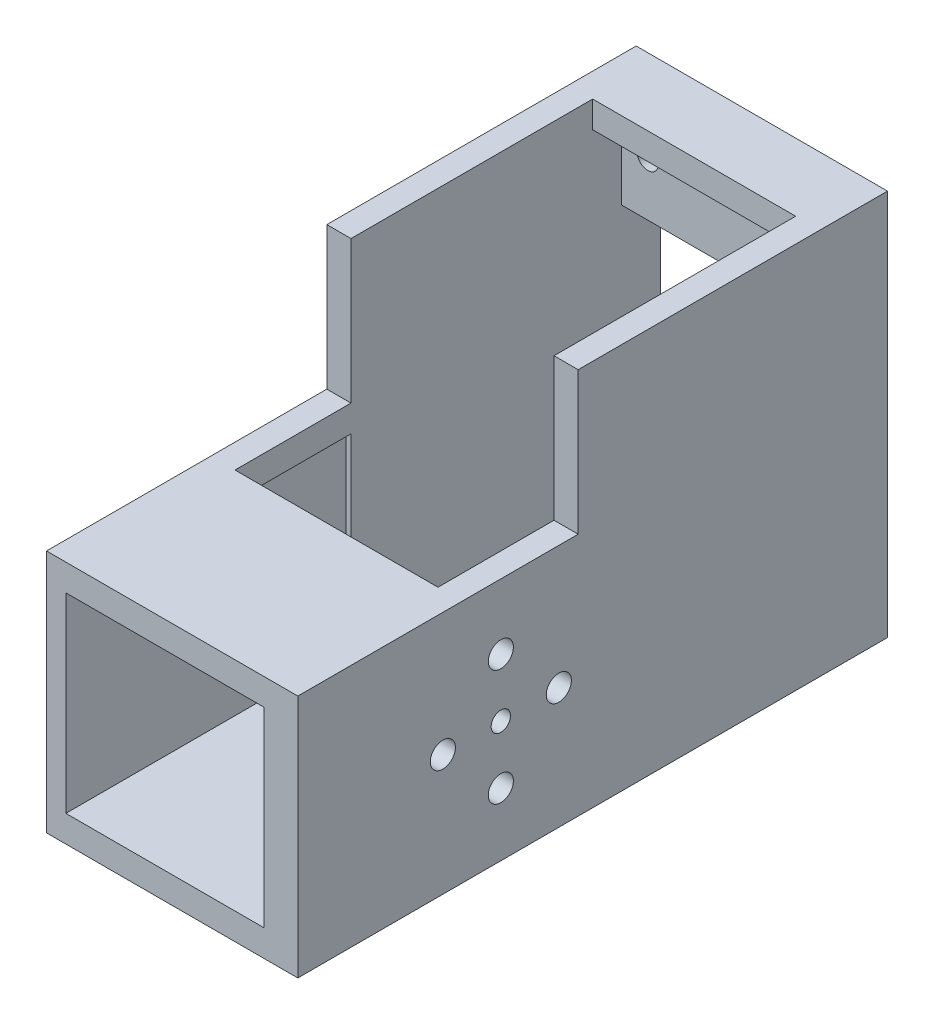
ISO-10303-21;
HEADER;
FILE_DESCRIPTION(('STEP AP214'),'2;1');
FILE_NAME('part.step','',(''),(''),'','','');
FILE_SCHEMA(('AUTOMOTIVE_DESIGN { 1 0 10303 214 1 1 1 1 }'));
ENDSEC;
DATA;
#1=APPLICATION_CONTEXT('core data for automotive mechanical design processes');
#2=APPLICATION_PROTOCOL_DEFINITION('international standard','automotive_design',2000,#1);
#3=PRODUCT_CONTEXT('',#1,'mechanical');
#4=PRODUCT('Part','Part','',(#3));
#5=PRODUCT_RELATED_PRODUCT_CATEGORY('part','',(#4));
#6=PRODUCT_DEFINITION_FORMATION('','',#4);
#7=PRODUCT_DEFINITION_CONTEXT('part definition',#1,'design');
#8=PRODUCT_DEFINITION('design','',#6,#7);
#9=PRODUCT_DEFINITION_SHAPE('','',#8);
#10=(LENGTH_UNIT() NAMED_UNIT(*) SI_UNIT(.MILLI.,.METRE.));
#11=(NAMED_UNIT(*) PLANE_ANGLE_UNIT() SI_UNIT($,.RADIAN.));
#12=(NAMED_UNIT(*) SI_UNIT($,.STERADIAN.) SOLID_ANGLE_UNIT());
#13=UNCERTAINTY_MEASURE_WITH_UNIT(LENGTH_MEASURE(1.E-05),#10,'distance_accuracy_value','');
#14=(GEOMETRIC_REPRESENTATION_CONTEXT(3) GLOBAL_UNCERTAINTY_ASSIGNED_CONTEXT((#13)) GLOBAL_UNIT_ASSIGNED_CONTEXT((#10,
#11,#12)) REPRESENTATION_CONTEXT('',''));
#15=CARTESIAN_POINT('',(0.,0.,0.));
#16=DIRECTION('',(0.,0.,1.));
#17=DIRECTION('',(1.,0.,0.));
#18=AXIS2_PLACEMENT_3D('',#15,#16,#17);
#19=CARTESIAN_POINT('',(0.,0.,4.));
#20=DIRECTION('',(0.,0.,1.));
#21=DIRECTION('',(1.,0.,0.));
#22=AXIS2_PLACEMENT_3D('',#19,#20,#21);
#23=PLANE('',#22);
#24=DIRECTION('',(-1.,0.,0.));
#25=VECTOR('',#24,1.);
#26=CARTESIAN_POINT('',(-2.49999999999999,29.,4.));
#27=LINE('',#26,#25);
#28=CARTESIAN_POINT('',(-2.49999999999999,29.,4.));
#29=VERTEX_POINT('',#28);
#30=CARTESIAN_POINT('',(-23.5,29.,4.));
#31=VERTEX_POINT('',#30);
#32=EDGE_CURVE('E332',#29,#31,#27,.T.);
#33=ORIENTED_EDGE('',*,*,#32,.F.);
#34=DIRECTION('',(0.,1.,0.));
#35=VECTOR('',#34,1.);
#36=CARTESIAN_POINT('',(-2.5,37.25,4.));
#37=LINE('',#36,#35);
#38=CARTESIAN_POINT('',(-2.5,37.25,4.));
#39=VERTEX_POINT('',#38);
#40=EDGE_CURVE('E448',#29,#39,#37,.T.);
#41=ORIENTED_EDGE('',*,*,#40,.T.);
#42=DIRECTION('',(-1.,0.,0.));
#43=VECTOR('',#42,1.);
#44=CARTESIAN_POINT('',(-23.5,37.25,4.));
#45=LINE('',#44,#43);
#46=CARTESIAN_POINT('',(-23.5,37.25,4.));
#47=VERTEX_POINT('',#46);
#48=EDGE_CURVE('E453',#39,#47,#45,.T.);
#49=ORIENTED_EDGE('',*,*,#48,.T.);
#50=DIRECTION('',(0.,-1.,0.));
#51=VECTOR('',#50,1.);
#52=CARTESIAN_POINT('',(-23.5,37.25,4.));
#53=LINE('',#52,#51);
#54=EDGE_CURVE('E439',#47,#31,#53,.T.);
#55=ORIENTED_EDGE('',*,*,#54,.T.);
#56=EDGE_LOOP('',(#33,#41,#49,#55));
#57=FACE_BOUND('',#56,.T.);
#58=CARTESIAN_POINT('',(-20.7999999999999,34.55,4.));
#59=DIRECTION('',(0.,0.,1.));
#60=DIRECTION('',(1.,0.,0.));
#61=AXIS2_PLACEMENT_3D('',#58,#59,#60);
#62=CIRCLE('',#61,1.1);
#63=CARTESIAN_POINT('',(-19.6999999999999,34.55,4.));
#64=VERTEX_POINT('',#63);
#65=EDGE_CURVE('E527',#64,#64,#62,.T.);
#66=ORIENTED_EDGE('',*,*,#65,.F.);
#67=EDGE_LOOP('',(#66));
#68=FACE_BOUND('',#67,.T.);
#69=CARTESIAN_POINT('',(-4.7999999999999,34.55,4.));
#70=DIRECTION('',(0.,0.,1.));
#71=DIRECTION('',(1.,0.,0.));
#72=AXIS2_PLACEMENT_3D('',#69,#70,#71);
#73=CIRCLE('',#72,1.1);
#74=CARTESIAN_POINT('',(-3.6999999999999,34.55,4.));
#75=VERTEX_POINT('',#74);
#76=EDGE_CURVE('E392',#75,#75,#73,.T.);
#77=ORIENTED_EDGE('',*,*,#76,.F.);
#78=EDGE_LOOP('',(#77));
#79=FACE_BOUND('',#78,.T.);
#80=ADVANCED_FACE('F46',(#57,#68,#79),#23,.T.);
#81=CARTESIAN_POINT('',(-26.,0.,32.));
#82=DIRECTION('',(1.,0.,0.));
#83=DIRECTION('',(0.,0.,-1.));
#84=AXIS2_PLACEMENT_3D('',#81,#82,#83);
#85=PLANE('',#84);
#86=DIRECTION('',(0.,0.,-1.));
#87=VECTOR('',#86,1.);
#88=CARTESIAN_POINT('',(-26.,0.,32.));
#89=LINE('',#88,#87);
#90=CARTESIAN_POINT('',(-26.,0.,61.));
#91=VERTEX_POINT('',#90);
#92=CARTESIAN_POINT('',(-26.,0.,0.));
#93=VERTEX_POINT('',#92);
#94=EDGE_CURVE('E509',#91,#93,#89,.T.);
#95=ORIENTED_EDGE('',*,*,#94,.F.);
#96=DIRECTION('',(0.,-1.,0.));
#97=VECTOR('',#96,1.);
#98=CARTESIAN_POINT('',(-26.,0.,61.));
#99=LINE('',#98,#97);
#100=CARTESIAN_POINT('',(-26.,25.26,61.));
#101=VERTEX_POINT('',#100);
#102=EDGE_CURVE('E273',#101,#91,#99,.T.);
#103=ORIENTED_EDGE('',*,*,#102,.F.);
#104=DIRECTION('',(0.,0.,-1.));
#105=VECTOR('',#104,1.);
#106=CARTESIAN_POINT('',(-26.,25.26,52.));
#107=LINE('',#106,#105);
#108=CARTESIAN_POINT('',(-26.,25.26,32.));
#109=VERTEX_POINT('',#108);
#110=EDGE_CURVE('E431',#101,#109,#107,.T.);
#111=ORIENTED_EDGE('',*,*,#110,.T.);
#112=DIRECTION('',(0.,-1.,0.));
#113=VECTOR('',#112,1.);
#114=CARTESIAN_POINT('',(-26.,0.,32.));
#115=LINE('',#114,#113);
#116=CARTESIAN_POINT('',(-26.,40.,32.));
#117=VERTEX_POINT('',#116);
#118=EDGE_CURVE('E489',#117,#109,#115,.T.);
#119=ORIENTED_EDGE('',*,*,#118,.F.);
#120=DIRECTION('',(0.,0.,-1.));
#121=VECTOR('',#120,1.);
#122=CARTESIAN_POINT('',(-26.,40.,32.));
#123=LINE('',#122,#121);
#124=CARTESIAN_POINT('',(-26.,40.,0.));
#125=VERTEX_POINT('',#124);
#126=EDGE_CURVE('E512',#117,#125,#123,.T.);
#127=ORIENTED_EDGE('',*,*,#126,.T.);
#128=DIRECTION('',(0.,-1.,0.));
#129=VECTOR('',#128,1.);
#130=CARTESIAN_POINT('',(-26.,0.,0.));
#131=LINE('',#130,#129);
#132=EDGE_CURVE('E500',#125,#93,#131,.T.);
#133=ORIENTED_EDGE('',*,*,#132,.T.);
#134=EDGE_LOOP('',(#95,#103,#111,#119,#127,#133));
#135=FACE_BOUND('',#134,.T.);
#136=CARTESIAN_POINT('',(-26.,12.51,40.));
#137=DIRECTION('',(1.,0.,0.));
#138=DIRECTION('',(0.,0.,-1.));
#139=AXIS2_PLACEMENT_3D('',#136,#137,#138);
#140=CIRCLE('',#139,4.8);
#141=CARTESIAN_POINT('',(-26.,12.51,35.2));
#142=VERTEX_POINT('',#141);
#143=EDGE_CURVE('E537',#142,#142,#140,.F.);
#144=ORIENTED_EDGE('',*,*,#143,.F.);
#145=EDGE_LOOP('',(#144));
#146=FACE_BOUND('',#145,.T.);
#147=ADVANCED_FACE('F629',(#135,#146),#85,.F.);
#148=CARTESIAN_POINT('',(0.,0.,32.));
#149=DIRECTION('',(-1.,0.,0.));
#150=DIRECTION('',(0.,0.,1.));
#151=AXIS2_PLACEMENT_3D('',#148,#149,#150);
#152=PLANE('',#151);
#153=CARTESIAN_POINT('',(0.,12.51,46.));
#154=DIRECTION('',(-1.,0.,0.));
#155=DIRECTION('',(0.,0.,1.));
#156=AXIS2_PLACEMENT_3D('',#153,#154,#155);
#157=CIRCLE('',#156,1.3);
#158=CARTESIAN_POINT('',(0.,12.51,47.3));
#159=VERTEX_POINT('',#158);
#160=EDGE_CURVE('E310',#159,#159,#157,.F.);
#161=ORIENTED_EDGE('',*,*,#160,.F.);
#162=EDGE_LOOP('',(#161));
#163=FACE_BOUND('',#162,.T.);
#164=CARTESIAN_POINT('',(0.,12.51,34.));
#165=DIRECTION('',(-1.,0.,0.));
#166=DIRECTION('',(0.,0.,1.));
#167=AXIS2_PLACEMENT_3D('',#164,#165,#166);
#168=CIRCLE('',#167,1.3);
#169=CARTESIAN_POINT('',(0.,12.51,35.3));
#170=VERTEX_POINT('',#169);
#171=EDGE_CURVE('E305',#170,#170,#168,.F.);
#172=ORIENTED_EDGE('',*,*,#171,.F.);
#173=EDGE_LOOP('',(#172));
#174=FACE_BOUND('',#173,.T.);
#175=CARTESIAN_POINT('',(0.,18.51,40.));
#176=DIRECTION('',(-1.,0.,0.));
#177=DIRECTION('',(0.,0.,1.));
#178=AXIS2_PLACEMENT_3D('',#175,#176,#177);
#179=CIRCLE('',#178,1.3);
#180=CARTESIAN_POINT('',(0.,18.51,41.3));
#181=VERTEX_POINT('',#180);
#182=EDGE_CURVE('E300',#181,#181,#179,.F.);
#183=ORIENTED_EDGE('',*,*,#182,.F.);
#184=EDGE_LOOP('',(#183));
#185=FACE_BOUND('',#184,.T.);
#186=CARTESIAN_POINT('',(0.,6.51,40.));
#187=DIRECTION('',(-1.,0.,0.));
#188=DIRECTION('',(0.,0.,1.));
#189=AXIS2_PLACEMENT_3D('',#186,#187,#188);
#190=CIRCLE('',#189,1.3);
#191=CARTESIAN_POINT('',(0.,6.51,41.3));
#192=VERTEX_POINT('',#191);
#193=EDGE_CURVE('E295',#192,#192,#190,.F.);
#194=ORIENTED_EDGE('',*,*,#193,.F.);
#195=EDGE_LOOP('',(#194));
#196=FACE_BOUND('',#195,.T.);
#197=CARTESIAN_POINT('',(0.,12.51,40.));
#198=DIRECTION('',(-1.,0.,0.));
#199=DIRECTION('',(0.,0.,1.));
#200=AXIS2_PLACEMENT_3D('',#197,#198,#199);
#201=CIRCLE('',#200,0.999999999999998);
#202=CARTESIAN_POINT('',(0.,12.51,41.));
#203=VERTEX_POINT('',#202);
#204=EDGE_CURVE('E290',#203,#203,#201,.F.);
#205=ORIENTED_EDGE('',*,*,#204,.F.);
#206=EDGE_LOOP('',(#205));
#207=FACE_BOUND('',#206,.T.);
#208=DIRECTION('',(0.,0.,-1.));
#209=VECTOR('',#208,1.);
#210=CARTESIAN_POINT('',(0.,25.26,52.));
#211=LINE('',#210,#209);
#212=CARTESIAN_POINT('',(0.,25.26,61.));
#213=VERTEX_POINT('',#212);
#214=CARTESIAN_POINT('',(0.,25.26,32.));
#215=VERTEX_POINT('',#214);
#216=EDGE_CURVE('E435',#213,#215,#211,.T.);
#217=ORIENTED_EDGE('',*,*,#216,.F.);
#218=DIRECTION('',(0.,1.,0.));
#219=VECTOR('',#218,1.);
#220=CARTESIAN_POINT('',(0.,0.,61.));
#221=LINE('',#220,#219);
#222=CARTESIAN_POINT('',(0.,0.,61.));
#223=VERTEX_POINT('',#222);
#224=EDGE_CURVE('E281',#223,#213,#221,.T.);
#225=ORIENTED_EDGE('',*,*,#224,.F.);
#226=DIRECTION('',(0.,0.,-1.));
#227=VECTOR('',#226,1.);
#228=CARTESIAN_POINT('',(0.,0.,32.));
#229=LINE('',#228,#227);
#230=CARTESIAN_POINT('',(0.,0.,0.));
#231=VERTEX_POINT('',#230);
#232=EDGE_CURVE('E493',#223,#231,#229,.T.);
#233=ORIENTED_EDGE('',*,*,#232,.T.);
#234=DIRECTION('',(0.,1.,0.));
#235=VECTOR('',#234,1.);
#236=CARTESIAN_POINT('',(0.,0.,0.));
#237=LINE('',#236,#235);
#238=CARTESIAN_POINT('',(0.,40.,0.));
#239=VERTEX_POINT('',#238);
#240=EDGE_CURVE('E469',#231,#239,#237,.T.);
#241=ORIENTED_EDGE('',*,*,#240,.T.);
#242=DIRECTION('',(0.,0.,-1.));
#243=VECTOR('',#242,1.);
#244=CARTESIAN_POINT('',(0.,40.,32.));
#245=LINE('',#244,#243);
#246=CARTESIAN_POINT('',(0.,40.,32.));
#247=VERTEX_POINT('',#246);
#248=EDGE_CURVE('E516',#247,#239,#245,.T.);
#249=ORIENTED_EDGE('',*,*,#248,.F.);
#250=DIRECTION('',(0.,1.,0.));
#251=VECTOR('',#250,1.);
#252=CARTESIAN_POINT('',(0.,0.,32.));
#253=LINE('',#252,#251);
#254=EDGE_CURVE('E480',#215,#247,#253,.T.);
#255=ORIENTED_EDGE('',*,*,#254,.F.);
#256=EDGE_LOOP('',(#217,#225,#233,#241,#249,#255));
#257=FACE_BOUND('',#256,.T.);
#258=ADVANCED_FACE('F48',(#163,#174,#185,#196,#207,#257),#152,.F.);
#259=CARTESIAN_POINT('',(0.,0.,32.));
#260=DIRECTION('',(0.,1.,0.));
#261=DIRECTION('',(-1.,0.,0.));
#262=AXIS2_PLACEMENT_3D('',#259,#260,#261);
#263=PLANE('',#262);
#264=ORIENTED_EDGE('',*,*,#232,.F.);
#265=DIRECTION('',(1.,0.,0.));
#266=VECTOR('',#265,1.);
#267=CARTESIAN_POINT('',(0.,0.,61.));
#268=LINE('',#267,#266);
#269=EDGE_CURVE('E277',#91,#223,#268,.T.);
#270=ORIENTED_EDGE('',*,*,#269,.F.);
#271=ORIENTED_EDGE('',*,*,#94,.T.);
#272=DIRECTION('',(1.,0.,0.));
#273=VECTOR('',#272,1.);
#274=CARTESIAN_POINT('',(0.,0.,0.));
#275=LINE('',#274,#273);
#276=EDGE_CURVE('E484',#93,#231,#275,.T.);
#277=ORIENTED_EDGE('',*,*,#276,.T.);
#278=EDGE_LOOP('',(#264,#270,#271,#277));
#279=FACE_BOUND('',#278,.T.);
#280=ADVANCED_FACE('F637',(#279),#263,.F.);
#281=CARTESIAN_POINT('',(-23.5,2.75,4.));
#282=DIRECTION('',(0.,-1.,0.));
#283=DIRECTION('',(1.,0.,0.));
#284=AXIS2_PLACEMENT_3D('',#281,#282,#283);
#285=PLANE('',#284);
#286=DIRECTION('',(0.,0.,1.));
#287=VECTOR('',#286,1.);
#288=CARTESIAN_POINT('',(-24.,2.75,32.));
#289=LINE('',#288,#287);
#290=CARTESIAN_POINT('',(-24.,2.75,32.));
#291=VERTEX_POINT('',#290);
#292=CARTESIAN_POINT('',(-24.,2.75,61.));
#293=VERTEX_POINT('',#292);
#294=EDGE_CURVE('E422',#291,#293,#289,.T.);
#295=ORIENTED_EDGE('',*,*,#294,.T.);
#296=DIRECTION('',(1.,0.,0.));
#297=VECTOR('',#296,1.);
#298=CARTESIAN_POINT('',(0.,2.75,61.));
#299=LINE('',#298,#297);
#300=CARTESIAN_POINT('',(-3.5,2.75,61.));
#301=VERTEX_POINT('',#300);
#302=EDGE_CURVE('E257',#293,#301,#299,.T.);
#303=ORIENTED_EDGE('',*,*,#302,.T.);
#304=DIRECTION('',(0.,0.,1.));
#305=VECTOR('',#304,1.);
#306=CARTESIAN_POINT('',(-3.5,2.75,32.));
#307=LINE('',#306,#305);
#308=CARTESIAN_POINT('',(-3.5,2.75,32.));
#309=VERTEX_POINT('',#308);
#310=EDGE_CURVE('E322',#309,#301,#307,.T.);
#311=ORIENTED_EDGE('',*,*,#310,.F.);
#312=DIRECTION('',(1.,0.,0.));
#313=VECTOR('',#312,1.);
#314=CARTESIAN_POINT('',(-2.,2.75,32.));
#315=LINE('',#314,#313);
#316=CARTESIAN_POINT('',(-2.49999999999999,2.75,32.));
#317=VERTEX_POINT('',#316);
#318=EDGE_CURVE('E317',#309,#317,#315,.T.);
#319=ORIENTED_EDGE('',*,*,#318,.T.);
#320=DIRECTION('',(0.,0.,1.));
#321=VECTOR('',#320,1.);
#322=CARTESIAN_POINT('',(-2.49999999999999,2.75,4.));
#323=LINE('',#322,#321);
#324=CARTESIAN_POINT('',(-2.49999999999999,2.75,4.));
#325=VERTEX_POINT('',#324);
#326=EDGE_CURVE('E474',#325,#317,#323,.T.);
#327=ORIENTED_EDGE('',*,*,#326,.F.);
#328=DIRECTION('',(1.,0.,0.));
#329=VECTOR('',#328,1.);
#330=CARTESIAN_POINT('',(-23.5,2.75,4.));
#331=LINE('',#330,#329);
#332=CARTESIAN_POINT('',(-23.5,2.75,4.));
#333=VERTEX_POINT('',#332);
#334=EDGE_CURVE('E443',#333,#325,#331,.T.);
#335=ORIENTED_EDGE('',*,*,#334,.F.);
#336=DIRECTION('',(0.,0.,1.));
#337=VECTOR('',#336,1.);
#338=CARTESIAN_POINT('',(-23.5,2.75,4.));
#339=LINE('',#338,#337);
#340=CARTESIAN_POINT('',(-23.5,2.75,32.));
#341=VERTEX_POINT('',#340);
#342=EDGE_CURVE('E457',#333,#341,#339,.T.);
#343=ORIENTED_EDGE('',*,*,#342,.T.);
#344=DIRECTION('',(1.,0.,0.));
#345=VECTOR('',#344,1.);
#346=CARTESIAN_POINT('',(-2.,2.75,32.));
#347=LINE('',#346,#345);
#348=EDGE_CURVE('E417',#291,#341,#347,.T.);
#349=ORIENTED_EDGE('',*,*,#348,.F.);
#350=EDGE_LOOP('',(#295,#303,#311,#319,#327,#335,#343,#349));
#351=FACE_BOUND('',#350,.T.);
#352=ADVANCED_FACE('F576',(#351),#285,.F.);
#353=CARTESIAN_POINT('',(0.,25.26,52.));
#354=DIRECTION('',(0.,-1.,0.));
#355=DIRECTION('',(1.,0.,0.));
#356=AXIS2_PLACEMENT_3D('',#353,#354,#355);
#357=PLANE('',#356);
#358=DIRECTION('',(-1.,0.,0.));
#359=VECTOR('',#358,1.);
#360=CARTESIAN_POINT('',(0.,25.26,32.));
#361=LINE('',#360,#359);
#362=CARTESIAN_POINT('',(-2.5,25.26,32.));
#363=VERTEX_POINT('',#362);
#364=EDGE_CURVE('E425',#215,#363,#361,.T.);
#365=ORIENTED_EDGE('',*,*,#364,.T.);
#366=DIRECTION('',(0.,0.,-1.));
#367=VECTOR('',#366,1.);
#368=CARTESIAN_POINT('',(-2.5,25.26,32.));
#369=LINE('',#368,#367);
#370=CARTESIAN_POINT('',(-2.5,25.26,44.));
#371=VERTEX_POINT('',#370);
#372=EDGE_CURVE('E247',#371,#363,#369,.T.);
#373=ORIENTED_EDGE('',*,*,#372,.F.);
#374=DIRECTION('',(1.,0.,0.));
#375=VECTOR('',#374,1.);
#376=CARTESIAN_POINT('',(-2.5,25.26,44.));
#377=LINE('',#376,#375);
#378=CARTESIAN_POINT('',(-23.5,25.26,44.));
#379=VERTEX_POINT('',#378);
#380=EDGE_CURVE('E224',#379,#371,#377,.T.);
#381=ORIENTED_EDGE('',*,*,#380,.F.);
#382=DIRECTION('',(0.,0.,1.));
#383=VECTOR('',#382,1.);
#384=CARTESIAN_POINT('',(-23.5,25.26,44.));
#385=LINE('',#384,#383);
#386=CARTESIAN_POINT('',(-23.5,25.26,32.));
#387=VERTEX_POINT('',#386);
#388=EDGE_CURVE('E241',#387,#379,#385,.T.);
#389=ORIENTED_EDGE('',*,*,#388,.F.);
#390=EDGE_CURVE('E432',#387,#109,#361,.T.);
#391=ORIENTED_EDGE('',*,*,#390,.T.);
#392=ORIENTED_EDGE('',*,*,#110,.F.);
#393=DIRECTION('',(-1.,0.,0.));
#394=VECTOR('',#393,1.);
#395=CARTESIAN_POINT('',(0.,25.26,61.));
#396=LINE('',#395,#394);
#397=EDGE_CURVE('E285',#213,#101,#396,.T.);
#398=ORIENTED_EDGE('',*,*,#397,.F.);
#399=ORIENTED_EDGE('',*,*,#216,.T.);
#400=EDGE_LOOP('',(#365,#373,#381,#389,#391,#392,#398,#399));
#401=FACE_BOUND('',#400,.T.);
#402=ADVANCED_FACE('F614',(#401),#357,.F.);
#403=CARTESIAN_POINT('',(-24.,2.75,32.));
#404=DIRECTION('',(-1.,0.,0.));
#405=DIRECTION('',(0.,-1.,0.));
#406=AXIS2_PLACEMENT_3D('',#403,#404,#405);
#407=PLANE('',#406);
#408=CARTESIAN_POINT('',(-24.,12.51,40.));
#409=DIRECTION('',(-1.,0.,0.));
#410=DIRECTION('',(0.,-1.,0.));
#411=AXIS2_PLACEMENT_3D('',#408,#409,#410);
#412=CIRCLE('',#411,4.00000000000001);
#413=CARTESIAN_POINT('',(-24.,8.50999999999999,40.));
#414=VERTEX_POINT('',#413);
#415=EDGE_CURVE('E369',#414,#414,#412,.T.);
#416=ORIENTED_EDGE('',*,*,#415,.T.);
#417=EDGE_LOOP('',(#416));
#418=FACE_BOUND('',#417,.T.);
#419=DIRECTION('',(0.,0.,1.));
#420=VECTOR('',#419,1.);
#421=CARTESIAN_POINT('',(-24.,22.51,32.));
#422=LINE('',#421,#420);
#423=CARTESIAN_POINT('',(-24.,22.51,32.));
#424=VERTEX_POINT('',#423);
#425=CARTESIAN_POINT('',(-24.,22.51,61.));
#426=VERTEX_POINT('',#425);
#427=EDGE_CURVE('E421',#424,#426,#422,.T.);
#428=ORIENTED_EDGE('',*,*,#427,.T.);
#429=DIRECTION('',(0.,1.,0.));
#430=VECTOR('',#429,1.);
#431=CARTESIAN_POINT('',(-24.,0.,61.));
#432=LINE('',#431,#430);
#433=EDGE_CURVE('E261',#293,#426,#432,.T.);
#434=ORIENTED_EDGE('',*,*,#433,.F.);
#435=ORIENTED_EDGE('',*,*,#294,.F.);
#436=DIRECTION('',(0.,-1.,0.));
#437=VECTOR('',#436,1.);
#438=CARTESIAN_POINT('',(-24.,2.75,32.));
#439=LINE('',#438,#437);
#440=EDGE_CURVE('E413',#424,#291,#439,.T.);
#441=ORIENTED_EDGE('',*,*,#440,.F.);
#442=EDGE_LOOP('',(#428,#434,#435,#441));
#443=FACE_BOUND('',#442,.T.);
#444=ADVANCED_FACE('F799',(#418,#443),#407,.F.);
#445=CARTESIAN_POINT('',(-2.,22.51,32.));
#446=DIRECTION('',(0.,1.,0.));
#447=DIRECTION('',(-1.,0.,0.));
#448=AXIS2_PLACEMENT_3D('',#445,#446,#447);
#449=PLANE('',#448);
#450=DIRECTION('',(0.,0.,1.));
#451=VECTOR('',#450,1.);
#452=CARTESIAN_POINT('',(-23.5,22.51,32.));
#453=LINE('',#452,#451);
#454=CARTESIAN_POINT('',(-23.5,22.51,32.));
#455=VERTEX_POINT('',#454);
#456=CARTESIAN_POINT('',(-23.5,22.51,44.));
#457=VERTEX_POINT('',#456);
#458=EDGE_CURVE('E253',#455,#457,#453,.T.);
#459=ORIENTED_EDGE('',*,*,#458,.T.);
#460=DIRECTION('',(1.,0.,0.));
#461=VECTOR('',#460,1.);
#462=CARTESIAN_POINT('',(-2.,22.51,44.));
#463=LINE('',#462,#461);
#464=CARTESIAN_POINT('',(-3.5,22.51,44.));
#465=VERTEX_POINT('',#464);
#466=EDGE_CURVE('E228',#457,#465,#463,.T.);
#467=ORIENTED_EDGE('',*,*,#466,.T.);
#468=DIRECTION('',(0.,0.,1.));
#469=VECTOR('',#468,1.);
#470=CARTESIAN_POINT('',(-3.5,22.51,32.));
#471=LINE('',#470,#469);
#472=CARTESIAN_POINT('',(-3.5,22.51,61.));
#473=VERTEX_POINT('',#472);
#474=EDGE_CURVE('E321',#465,#473,#471,.T.);
#475=ORIENTED_EDGE('',*,*,#474,.T.);
#476=DIRECTION('',(1.,0.,0.));
#477=VECTOR('',#476,1.);
#478=CARTESIAN_POINT('',(0.,22.51,61.));
#479=LINE('',#478,#477);
#480=EDGE_CURVE('E265',#426,#473,#479,.T.);
#481=ORIENTED_EDGE('',*,*,#480,.F.);
#482=ORIENTED_EDGE('',*,*,#427,.F.);
#483=DIRECTION('',(-1.,0.,0.));
#484=VECTOR('',#483,1.);
#485=CARTESIAN_POINT('',(-2.,22.51,32.));
#486=LINE('',#485,#484);
#487=EDGE_CURVE('E407',#455,#424,#486,.T.);
#488=ORIENTED_EDGE('',*,*,#487,.F.);
#489=EDGE_LOOP('',(#459,#467,#475,#481,#482,#488));
#490=FACE_BOUND('',#489,.T.);
#491=ADVANCED_FACE('F737',(#490),#449,.F.);
#492=CARTESIAN_POINT('',(0.,0.,32.));
#493=DIRECTION('',(0.,0.,1.));
#494=DIRECTION('',(1.,0.,0.));
#495=AXIS2_PLACEMENT_3D('',#492,#493,#494);
#496=PLANE('',#495);
#497=DIRECTION('',(-1.,0.,0.));
#498=VECTOR('',#497,1.);
#499=CARTESIAN_POINT('',(0.,40.,32.));
#500=LINE('',#499,#498);
#501=CARTESIAN_POINT('',(-2.5,40.,32.));
#502=VERTEX_POINT('',#501);
#503=EDGE_CURVE('E485',#247,#502,#500,.T.);
#504=ORIENTED_EDGE('',*,*,#503,.T.);
#505=DIRECTION('',(0.,1.,0.));
#506=VECTOR('',#505,1.);
#507=CARTESIAN_POINT('',(-2.5,37.25,32.));
#508=LINE('',#507,#506);
#509=EDGE_CURVE('E462',#363,#502,#508,.T.);
#510=ORIENTED_EDGE('',*,*,#509,.F.);
#511=ORIENTED_EDGE('',*,*,#364,.F.);
#512=ORIENTED_EDGE('',*,*,#254,.T.);
#513=EDGE_LOOP('',(#504,#510,#511,#512));
#514=FACE_BOUND('',#513,.T.);
#515=ADVANCED_FACE('F618',(#514),#496,.T.);
#516=CARTESIAN_POINT('',(-23.5,37.25,4.));
#517=DIRECTION('',(0.,1.,0.));
#518=DIRECTION('',(0.,0.,1.));
#519=AXIS2_PLACEMENT_3D('',#516,#517,#518);
#520=PLANE('',#519);
#521=DIRECTION('',(1.,0.,0.));
#522=VECTOR('',#521,1.);
#523=CARTESIAN_POINT('',(-2.5,37.25,7.));
#524=LINE('',#523,#522);
#525=CARTESIAN_POINT('',(-23.5,37.25,7.));
#526=VERTEX_POINT('',#525);
#527=CARTESIAN_POINT('',(-2.5,37.25,7.));
#528=VERTEX_POINT('',#527);
#529=EDGE_CURVE('E399',#526,#528,#524,.T.);
#530=ORIENTED_EDGE('',*,*,#529,.F.);
#531=DIRECTION('',(0.,0.,1.));
#532=VECTOR('',#531,1.);
#533=CARTESIAN_POINT('',(-23.5,37.25,4.));
#534=LINE('',#533,#532);
#535=EDGE_CURVE('E465',#47,#526,#534,.T.);
#536=ORIENTED_EDGE('',*,*,#535,.F.);
#537=ORIENTED_EDGE('',*,*,#48,.F.);
#538=DIRECTION('',(0.,0.,1.));
#539=VECTOR('',#538,1.);
#540=CARTESIAN_POINT('',(-2.5,37.25,4.));
#541=LINE('',#540,#539);
#542=EDGE_CURVE('E470',#39,#528,#541,.T.);
#543=ORIENTED_EDGE('',*,*,#542,.T.);
#544=EDGE_LOOP('',(#530,#536,#537,#543));
#545=FACE_BOUND('',#544,.T.);
#546=ADVANCED_FACE('F599',(#545),#520,.F.);
#547=CARTESIAN_POINT('',(0.,40.,32.));
#548=DIRECTION('',(0.,-1.,0.));
#549=DIRECTION('',(0.,0.,-1.));
#550=AXIS2_PLACEMENT_3D('',#547,#548,#549);
#551=PLANE('',#550);
#552=DIRECTION('',(-1.,0.,0.));
#553=VECTOR('',#552,1.);
#554=CARTESIAN_POINT('',(-2.5,40.,7.));
#555=LINE('',#554,#553);
#556=CARTESIAN_POINT('',(-2.5,40.,7.));
#557=VERTEX_POINT('',#556);
#558=CARTESIAN_POINT('',(-23.5,40.,7.));
#559=VERTEX_POINT('',#558);
#560=EDGE_CURVE('E391',#557,#559,#555,.T.);
#561=ORIENTED_EDGE('',*,*,#560,.F.);
#562=DIRECTION('',(0.,0.,1.));
#563=VECTOR('',#562,1.);
#564=CARTESIAN_POINT('',(-2.5,40.,7.));
#565=LINE('',#564,#563);
#566=EDGE_CURVE('E402',#557,#502,#565,.T.);
#567=ORIENTED_EDGE('',*,*,#566,.T.);
#568=ORIENTED_EDGE('',*,*,#503,.F.);
#569=ORIENTED_EDGE('',*,*,#248,.T.);
#570=DIRECTION('',(-1.,0.,0.));
#571=VECTOR('',#570,1.);
#572=CARTESIAN_POINT('',(0.,40.,0.));
#573=LINE('',#572,#571);
#574=EDGE_CURVE('E497',#239,#125,#573,.T.);
#575=ORIENTED_EDGE('',*,*,#574,.T.);
#576=ORIENTED_EDGE('',*,*,#126,.F.);
#577=CARTESIAN_POINT('',(-23.5,40.,32.));
#578=VERTEX_POINT('',#577);
#579=EDGE_CURVE('E483',#578,#117,#500,.T.);
#580=ORIENTED_EDGE('',*,*,#579,.F.);
#581=DIRECTION('',(0.,0.,1.));
#582=VECTOR('',#581,1.);
#583=CARTESIAN_POINT('',(-23.5,40.,7.));
#584=LINE('',#583,#582);
#585=EDGE_CURVE('E403',#559,#578,#584,.T.);
#586=ORIENTED_EDGE('',*,*,#585,.F.);
#587=EDGE_LOOP('',(#561,#567,#568,#569,#575,#576,#580,#586));
#588=FACE_BOUND('',#587,.T.);
#589=ADVANCED_FACE('F607',(#588),#551,.F.);
#590=DIRECTION('',(0.,-1.,0.));
#591=VECTOR('',#590,1.);
#592=CARTESIAN_POINT('',(-23.5,37.25,32.));
#593=LINE('',#592,#591);
#594=EDGE_CURVE('E458',#578,#387,#593,.T.);
#595=ORIENTED_EDGE('',*,*,#594,.F.);
#596=ORIENTED_EDGE('',*,*,#579,.T.);
#597=ORIENTED_EDGE('',*,*,#118,.T.);
#598=ORIENTED_EDGE('',*,*,#390,.F.);
#599=EDGE_LOOP('',(#595,#596,#597,#598));
#600=FACE_BOUND('',#599,.T.);
#601=ADVANCED_FACE('F611',(#600),#496,.T.);
#602=CARTESIAN_POINT('',(0.,0.,0.));
#603=DIRECTION('',(0.,0.,1.));
#604=DIRECTION('',(1.,0.,0.));
#605=AXIS2_PLACEMENT_3D('',#602,#603,#604);
#606=PLANE('',#605);
#607=DIRECTION('',(0.,1.,0.));
#608=VECTOR('',#607,1.);
#609=CARTESIAN_POINT('',(-2.5,12.,0.));
#610=LINE('',#609,#608);
#611=CARTESIAN_POINT('',(-2.5,12.,0.));
#612=VERTEX_POINT('',#611);
#613=CARTESIAN_POINT('',(-2.49999999999999,29.,0.));
#614=VERTEX_POINT('',#613);
#615=EDGE_CURVE('E335',#612,#614,#610,.T.);
#616=ORIENTED_EDGE('',*,*,#615,.T.);
#617=DIRECTION('',(-1.,0.,0.));
#618=VECTOR('',#617,1.);
#619=CARTESIAN_POINT('',(-2.49999999999999,29.,0.));
#620=LINE('',#619,#618);
#621=CARTESIAN_POINT('',(-23.5,29.,0.));
#622=VERTEX_POINT('',#621);
#623=EDGE_CURVE('E339',#614,#622,#620,.T.);
#624=ORIENTED_EDGE('',*,*,#623,.T.);
#625=DIRECTION('',(0.,-1.,0.));
#626=VECTOR('',#625,1.);
#627=CARTESIAN_POINT('',(-23.5,20.,0.));
#628=LINE('',#627,#626);
#629=CARTESIAN_POINT('',(-23.5,12.,0.));
#630=VERTEX_POINT('',#629);
#631=EDGE_CURVE('E328',#622,#630,#628,.T.);
#632=ORIENTED_EDGE('',*,*,#631,.T.);
#633=DIRECTION('',(1.,0.,0.));
#634=VECTOR('',#633,1.);
#635=CARTESIAN_POINT('',(-23.5,12.,0.));
#636=LINE('',#635,#634);
#637=EDGE_CURVE('E70',#630,#612,#636,.T.);
#638=ORIENTED_EDGE('',*,*,#637,.T.);
#639=EDGE_LOOP('',(#616,#624,#632,#638));
#640=FACE_BOUND('',#639,.T.);
#641=CARTESIAN_POINT('',(-4.7999999999999,34.55,0.));
#642=DIRECTION('',(0.,0.,-1.));
#643=DIRECTION('',(-1.,0.,0.));
#644=AXIS2_PLACEMENT_3D('',#641,#642,#643);
#645=CIRCLE('',#644,1.1);
#646=CARTESIAN_POINT('',(-5.89999999999989,34.55,0.));
#647=VERTEX_POINT('',#646);
#648=EDGE_CURVE('E379',#647,#647,#645,.T.);
#649=ORIENTED_EDGE('',*,*,#648,.F.);
#650=EDGE_LOOP('',(#649));
#651=FACE_BOUND('',#650,.T.);
#652=CARTESIAN_POINT('',(-20.7999999999999,34.55,0.));
#653=DIRECTION('',(0.,0.,-1.));
#654=DIRECTION('',(-1.,0.,0.));
#655=AXIS2_PLACEMENT_3D('',#652,#653,#654);
#656=CIRCLE('',#655,1.1);
#657=CARTESIAN_POINT('',(-21.8999999999999,34.55,0.));
#658=VERTEX_POINT('',#657);
#659=EDGE_CURVE('E375',#658,#658,#656,.T.);
#660=ORIENTED_EDGE('',*,*,#659,.F.);
#661=EDGE_LOOP('',(#660));
#662=FACE_BOUND('',#661,.T.);
#663=CARTESIAN_POINT('',(-20.8,4.55,0.));
#664=DIRECTION('',(0.,0.,-1.));
#665=DIRECTION('',(-1.,0.,0.));
#666=AXIS2_PLACEMENT_3D('',#663,#664,#665);
#667=CIRCLE('',#666,1.1);
#668=CARTESIAN_POINT('',(-21.9,4.55,0.));
#669=VERTEX_POINT('',#668);
#670=EDGE_CURVE('E370',#669,#669,#667,.T.);
#671=ORIENTED_EDGE('',*,*,#670,.F.);
#672=EDGE_LOOP('',(#671));
#673=FACE_BOUND('',#672,.T.);
#674=CARTESIAN_POINT('',(-4.8,4.55,0.));
#675=DIRECTION('',(0.,0.,-1.));
#676=DIRECTION('',(-1.,0.,0.));
#677=AXIS2_PLACEMENT_3D('',#674,#675,#676);
#678=CIRCLE('',#677,1.1);
#679=CARTESIAN_POINT('',(-5.9,4.55,0.));
#680=VERTEX_POINT('',#679);
#681=EDGE_CURVE('E374',#680,#680,#678,.T.);
#682=ORIENTED_EDGE('',*,*,#681,.F.);
#683=EDGE_LOOP('',(#682));
#684=FACE_BOUND('',#683,.T.);
#685=ORIENTED_EDGE('',*,*,#240,.F.);
#686=ORIENTED_EDGE('',*,*,#276,.F.);
#687=ORIENTED_EDGE('',*,*,#132,.F.);
#688=ORIENTED_EDGE('',*,*,#574,.F.);
#689=EDGE_LOOP('',(#685,#686,#687,#688));
#690=FACE_BOUND('',#689,.T.);
#691=ADVANCED_FACE('F584',(#640,#651,#662,#673,#684,#690),#606,.F.);
#692=CARTESIAN_POINT('',(-23.5,37.25,4.));
#693=DIRECTION('',(-1.,0.,0.));
#694=DIRECTION('',(0.,-1.,0.));
#695=AXIS2_PLACEMENT_3D('',#692,#693,#694);
#696=PLANE('',#695);
#697=ORIENTED_EDGE('',*,*,#594,.T.);
#698=ORIENTED_EDGE('',*,*,#388,.T.);
#699=DIRECTION('',(0.,1.,0.));
#700=VECTOR('',#699,1.);
#701=CARTESIAN_POINT('',(-23.5,20.26,44.));
#702=LINE('',#701,#700);
#703=EDGE_CURVE('E229',#457,#379,#702,.T.);
#704=ORIENTED_EDGE('',*,*,#703,.F.);
#705=ORIENTED_EDGE('',*,*,#458,.F.);
#706=EDGE_CURVE('E438',#455,#341,#593,.T.);
#707=ORIENTED_EDGE('',*,*,#706,.T.);
#708=ORIENTED_EDGE('',*,*,#342,.F.);
#709=CARTESIAN_POINT('',(-23.5,12.,4.));
#710=VERTEX_POINT('',#709);
#711=EDGE_CURVE('E444',#710,#333,#53,.T.);
#712=ORIENTED_EDGE('',*,*,#711,.F.);
#713=DIRECTION('',(0.,0.,1.));
#714=VECTOR('',#713,1.);
#715=CARTESIAN_POINT('',(-23.5,12.,0.));
#716=LINE('',#715,#714);
#717=EDGE_CURVE('E343',#630,#710,#716,.T.);
#718=ORIENTED_EDGE('',*,*,#717,.F.);
#719=ORIENTED_EDGE('',*,*,#631,.F.);
#720=DIRECTION('',(0.,0.,1.));
#721=VECTOR('',#720,1.);
#722=CARTESIAN_POINT('',(-23.5,29.,0.));
#723=LINE('',#722,#721);
#724=EDGE_CURVE('E349',#622,#31,#723,.T.);
#725=ORIENTED_EDGE('',*,*,#724,.T.);
#726=ORIENTED_EDGE('',*,*,#54,.F.);
#727=ORIENTED_EDGE('',*,*,#535,.T.);
#728=DIRECTION('',(0.,-1.,0.));
#729=VECTOR('',#728,1.);
#730=CARTESIAN_POINT('',(-23.5,37.25,7.));
#731=LINE('',#730,#729);
#732=EDGE_CURVE('E396',#559,#526,#731,.T.);
#733=ORIENTED_EDGE('',*,*,#732,.F.);
#734=ORIENTED_EDGE('',*,*,#585,.T.);
#735=EDGE_LOOP('',(#697,#698,#704,#705,#707,#708,#712,#718,#719,#725,#726,#727,#733,#734));
#736=FACE_BOUND('',#735,.T.);
#737=ADVANCED_FACE('F566',(#736),#696,.F.);
#738=CARTESIAN_POINT('',(-2.5,37.25,4.));
#739=DIRECTION('',(1.,0.,0.));
#740=DIRECTION('',(0.,1.,0.));
#741=AXIS2_PLACEMENT_3D('',#738,#739,#740);
#742=PLANE('',#741);
#743=CARTESIAN_POINT('',(-2.5,20.26,32.));
#744=VERTEX_POINT('',#743);
#745=EDGE_CURVE('E234',#317,#744,#508,.T.);
#746=ORIENTED_EDGE('',*,*,#745,.T.);
#747=DIRECTION('',(0.,0.,-1.));
#748=VECTOR('',#747,1.);
#749=CARTESIAN_POINT('',(-2.5,20.26,32.));
#750=LINE('',#749,#748);
#751=CARTESIAN_POINT('',(-2.5,20.26,44.));
#752=VERTEX_POINT('',#751);
#753=EDGE_CURVE('E215',#752,#744,#750,.T.);
#754=ORIENTED_EDGE('',*,*,#753,.F.);
#755=DIRECTION('',(0.,1.,0.));
#756=VECTOR('',#755,1.);
#757=CARTESIAN_POINT('',(-2.5,20.26,44.));
#758=LINE('',#757,#756);
#759=EDGE_CURVE('E221',#752,#371,#758,.T.);
#760=ORIENTED_EDGE('',*,*,#759,.T.);
#761=ORIENTED_EDGE('',*,*,#372,.T.);
#762=ORIENTED_EDGE('',*,*,#509,.T.);
#763=ORIENTED_EDGE('',*,*,#566,.F.);
#764=DIRECTION('',(0.,1.,0.));
#765=VECTOR('',#764,1.);
#766=CARTESIAN_POINT('',(-2.5,37.25,7.));
#767=LINE('',#766,#765);
#768=EDGE_CURVE('E387',#528,#557,#767,.T.);
#769=ORIENTED_EDGE('',*,*,#768,.F.);
#770=ORIENTED_EDGE('',*,*,#542,.F.);
#771=ORIENTED_EDGE('',*,*,#40,.F.);
#772=DIRECTION('',(0.,0.,1.));
#773=VECTOR('',#772,1.);
#774=CARTESIAN_POINT('',(-2.49999999999999,29.,0.));
#775=LINE('',#774,#773);
#776=EDGE_CURVE('E354',#614,#29,#775,.T.);
#777=ORIENTED_EDGE('',*,*,#776,.F.);
#778=ORIENTED_EDGE('',*,*,#615,.F.);
#779=DIRECTION('',(0.,0.,1.));
#780=VECTOR('',#779,1.);
#781=CARTESIAN_POINT('',(-2.5,12.,0.));
#782=LINE('',#781,#780);
#783=CARTESIAN_POINT('',(-2.5,12.,4.));
#784=VERTEX_POINT('',#783);
#785=EDGE_CURVE('E357',#612,#784,#782,.T.);
#786=ORIENTED_EDGE('',*,*,#785,.T.);
#787=EDGE_CURVE('E449',#325,#784,#37,.T.);
#788=ORIENTED_EDGE('',*,*,#787,.F.);
#789=ORIENTED_EDGE('',*,*,#326,.T.);
#790=EDGE_LOOP('',(#746,#754,#760,#761,#762,#763,#769,#770,#771,#777,#778,#786,#788,#789));
#791=FACE_BOUND('',#790,.T.);
#792=ADVANCED_FACE('F232',(#791),#742,.F.);
#793=DIRECTION('',(1.,0.,0.));
#794=VECTOR('',#793,1.);
#795=CARTESIAN_POINT('',(-23.5,12.,4.));
#796=LINE('',#795,#794);
#797=EDGE_CURVE('E325',#710,#784,#796,.T.);
#798=ORIENTED_EDGE('',*,*,#797,.F.);
#799=ORIENTED_EDGE('',*,*,#711,.T.);
#800=ORIENTED_EDGE('',*,*,#334,.T.);
#801=ORIENTED_EDGE('',*,*,#787,.T.);
#802=EDGE_LOOP('',(#798,#799,#800,#801));
#803=FACE_BOUND('',#802,.T.);
#804=CARTESIAN_POINT('',(-20.8,4.55,4.));
#805=DIRECTION('',(0.,0.,1.));
#806=DIRECTION('',(1.,0.,0.));
#807=AXIS2_PLACEMENT_3D('',#804,#805,#806);
#808=CIRCLE('',#807,1.1);
#809=CARTESIAN_POINT('',(-19.7,4.55,4.));
#810=VERTEX_POINT('',#809);
#811=EDGE_CURVE('E523',#810,#810,#808,.T.);
#812=ORIENTED_EDGE('',*,*,#811,.F.);
#813=EDGE_LOOP('',(#812));
#814=FACE_BOUND('',#813,.T.);
#815=CARTESIAN_POINT('',(-4.8,4.55,4.));
#816=DIRECTION('',(0.,0.,1.));
#817=DIRECTION('',(1.,0.,0.));
#818=AXIS2_PLACEMENT_3D('',#815,#816,#817);
#819=CIRCLE('',#818,1.1);
#820=CARTESIAN_POINT('',(-3.7,4.55,4.));
#821=VERTEX_POINT('',#820);
#822=EDGE_CURVE('E386',#821,#821,#819,.T.);
#823=ORIENTED_EDGE('',*,*,#822,.F.);
#824=EDGE_LOOP('',(#823));
#825=FACE_BOUND('',#824,.T.);
#826=ADVANCED_FACE('F580',(#803,#814,#825),#23,.T.);
#827=CARTESIAN_POINT('',(0.,0.,32.));
#828=DIRECTION('',(0.,0.,1.));
#829=DIRECTION('',(1.,0.,0.));
#830=AXIS2_PLACEMENT_3D('',#827,#828,#829);
#831=PLANE('',#830);
#832=DIRECTION('',(0.,-1.,0.));
#833=VECTOR('',#832,1.);
#834=CARTESIAN_POINT('',(-3.5,2.75,32.));
#835=LINE('',#834,#833);
#836=CARTESIAN_POINT('',(-3.5,20.26,32.));
#837=VERTEX_POINT('',#836);
#838=EDGE_CURVE('E314',#837,#309,#835,.T.);
#839=ORIENTED_EDGE('',*,*,#838,.F.);
#840=DIRECTION('',(-1.,0.,0.));
#841=VECTOR('',#840,1.);
#842=CARTESIAN_POINT('',(-2.5,20.26,32.));
#843=LINE('',#842,#841);
#844=EDGE_CURVE('E62',#744,#837,#843,.T.);
#845=ORIENTED_EDGE('',*,*,#844,.F.);
#846=ORIENTED_EDGE('',*,*,#745,.F.);
#847=ORIENTED_EDGE('',*,*,#318,.F.);
#848=EDGE_LOOP('',(#839,#845,#846,#847));
#849=FACE_BOUND('',#848,.T.);
#850=ADVANCED_FACE('F658',(#849),#831,.F.);
#851=CARTESIAN_POINT('',(0.,0.,32.));
#852=DIRECTION('',(0.,0.,1.));
#853=DIRECTION('',(1.,0.,0.));
#854=AXIS2_PLACEMENT_3D('',#851,#852,#853);
#855=PLANE('',#854);
#856=ORIENTED_EDGE('',*,*,#706,.F.);
#857=ORIENTED_EDGE('',*,*,#487,.T.);
#858=ORIENTED_EDGE('',*,*,#440,.T.);
#859=ORIENTED_EDGE('',*,*,#348,.T.);
#860=EDGE_LOOP('',(#856,#857,#858,#859));
#861=FACE_BOUND('',#860,.T.);
#862=ADVANCED_FACE('F573',(#861),#855,.T.);
#863=CARTESIAN_POINT('',(0.,0.,7.));
#864=DIRECTION('',(0.,0.,1.));
#865=DIRECTION('',(1.,0.,0.));
#866=AXIS2_PLACEMENT_3D('',#863,#864,#865);
#867=PLANE('',#866);
#868=ORIENTED_EDGE('',*,*,#768,.T.);
#869=ORIENTED_EDGE('',*,*,#560,.T.);
#870=ORIENTED_EDGE('',*,*,#732,.T.);
#871=ORIENTED_EDGE('',*,*,#529,.T.);
#872=EDGE_LOOP('',(#868,#869,#870,#871));
#873=FACE_BOUND('',#872,.T.);
#874=ADVANCED_FACE('F604',(#873),#867,.T.);
#875=CARTESIAN_POINT('',(-4.8,4.55,20.));
#876=DIRECTION('',(0.,0.,-1.));
#877=DIRECTION('',(-1.,0.,0.));
#878=AXIS2_PLACEMENT_3D('',#875,#876,#877);
#879=CYLINDRICAL_SURFACE('',#878,1.1);
#880=ORIENTED_EDGE('',*,*,#822,.T.);
#881=EDGE_LOOP('',(#880));
#882=FACE_BOUND('',#881,.T.);
#883=ORIENTED_EDGE('',*,*,#681,.T.);
#884=EDGE_LOOP('',(#883));
#885=FACE_BOUND('',#884,.T.);
#886=ADVANCED_FACE('F745',(#882,#885),#879,.F.);
#887=CARTESIAN_POINT('',(-20.8,4.55,20.));
#888=DIRECTION('',(0.,0.,-1.));
#889=DIRECTION('',(-1.,0.,0.));
#890=AXIS2_PLACEMENT_3D('',#887,#888,#889);
#891=CYLINDRICAL_SURFACE('',#890,1.1);
#892=ORIENTED_EDGE('',*,*,#811,.T.);
#893=EDGE_LOOP('',(#892));
#894=FACE_BOUND('',#893,.T.);
#895=ORIENTED_EDGE('',*,*,#670,.T.);
#896=EDGE_LOOP('',(#895));
#897=FACE_BOUND('',#896,.T.);
#898=ADVANCED_FACE('F753',(#894,#897),#891,.F.);
#899=CARTESIAN_POINT('',(-20.7999999999999,34.55,20.));
#900=DIRECTION('',(0.,0.,-1.));
#901=DIRECTION('',(-1.,0.,0.));
#902=AXIS2_PLACEMENT_3D('',#899,#900,#901);
#903=CYLINDRICAL_SURFACE('',#902,1.1);
#904=ORIENTED_EDGE('',*,*,#65,.T.);
#905=EDGE_LOOP('',(#904));
#906=FACE_BOUND('',#905,.T.);
#907=ORIENTED_EDGE('',*,*,#659,.T.);
#908=EDGE_LOOP('',(#907));
#909=FACE_BOUND('',#908,.T.);
#910=ADVANCED_FACE('F762',(#906,#909),#903,.F.);
#911=CARTESIAN_POINT('',(-4.7999999999999,34.55,20.));
#912=DIRECTION('',(0.,0.,-1.));
#913=DIRECTION('',(-1.,0.,0.));
#914=AXIS2_PLACEMENT_3D('',#911,#912,#913);
#915=CYLINDRICAL_SURFACE('',#914,1.1);
#916=ORIENTED_EDGE('',*,*,#76,.T.);
#917=EDGE_LOOP('',(#916));
#918=FACE_BOUND('',#917,.T.);
#919=ORIENTED_EDGE('',*,*,#648,.T.);
#920=EDGE_LOOP('',(#919));
#921=FACE_BOUND('',#920,.T.);
#922=ADVANCED_FACE('F771',(#918,#921),#915,.F.);
#923=CARTESIAN_POINT('',(-21.,12.51,40.));
#924=DIRECTION('',(-1.,0.,0.));
#925=DIRECTION('',(0.,0.,1.));
#926=AXIS2_PLACEMENT_3D('',#923,#924,#925);
#927=CYLINDRICAL_SURFACE('',#926,4.00000000000001);
#928=ORIENTED_EDGE('',*,*,#415,.F.);
#929=EDGE_LOOP('',(#928));
#930=FACE_BOUND('',#929,.T.);
#931=CARTESIAN_POINT('',(-29.,12.51,40.));
#932=DIRECTION('',(-1.,0.,0.));
#933=DIRECTION('',(0.,0.,1.));
#934=AXIS2_PLACEMENT_3D('',#931,#932,#933);
#935=CIRCLE('',#934,4.00000000000001);
#936=CARTESIAN_POINT('',(-29.,12.51,44.));
#937=VERTEX_POINT('',#936);
#938=EDGE_CURVE('E353',#937,#937,#935,.T.);
#939=ORIENTED_EDGE('',*,*,#938,.T.);
#940=EDGE_LOOP('',(#939));
#941=FACE_BOUND('',#940,.T.);
#942=ADVANCED_FACE('F780',(#930,#941),#927,.F.);
#943=CARTESIAN_POINT('',(-29.,12.51,40.));
#944=DIRECTION('',(-1.,0.,0.));
#945=DIRECTION('',(0.,0.,1.));
#946=AXIS2_PLACEMENT_3D('',#943,#944,#945);
#947=PLANE('',#946);
#948=CARTESIAN_POINT('',(-29.,12.51,40.));
#949=DIRECTION('',(-1.,0.,0.));
#950=DIRECTION('',(0.,0.,1.));
#951=AXIS2_PLACEMENT_3D('',#948,#949,#950);
#952=CIRCLE('',#951,4.8);
#953=CARTESIAN_POINT('',(-29.,12.51,44.8));
#954=VERTEX_POINT('',#953);
#955=EDGE_CURVE('E365',#954,#954,#952,.T.);
#956=ORIENTED_EDGE('',*,*,#955,.T.);
#957=EDGE_LOOP('',(#956));
#958=FACE_BOUND('',#957,.T.);
#959=ORIENTED_EDGE('',*,*,#938,.F.);
#960=EDGE_LOOP('',(#959));
#961=FACE_BOUND('',#960,.T.);
#962=ADVANCED_FACE('F789',(#958,#961),#947,.T.);
#963=CARTESIAN_POINT('',(-29.,12.51,40.));
#964=DIRECTION('',(1.,0.,0.));
#965=DIRECTION('',(0.,0.,-1.));
#966=AXIS2_PLACEMENT_3D('',#963,#964,#965);
#967=CYLINDRICAL_SURFACE('',#966,4.8);
#968=ORIENTED_EDGE('',*,*,#955,.F.);
#969=EDGE_LOOP('',(#968));
#970=FACE_BOUND('',#969,.T.);
#971=ORIENTED_EDGE('',*,*,#143,.T.);
#972=EDGE_LOOP('',(#971));
#973=FACE_BOUND('',#972,.T.);
#974=ADVANCED_FACE('F872',(#970,#973),#967,.T.);
#975=CARTESIAN_POINT('',(-2.49999999999999,29.,0.));
#976=DIRECTION('',(0.,1.,0.));
#977=DIRECTION('',(-1.,0.,0.));
#978=AXIS2_PLACEMENT_3D('',#975,#976,#977);
#979=PLANE('',#978);
#980=ORIENTED_EDGE('',*,*,#32,.T.);
#981=ORIENTED_EDGE('',*,*,#724,.F.);
#982=ORIENTED_EDGE('',*,*,#623,.F.);
#983=ORIENTED_EDGE('',*,*,#776,.T.);
#984=EDGE_LOOP('',(#980,#981,#982,#983));
#985=FACE_BOUND('',#984,.T.);
#986=ADVANCED_FACE('F589',(#985),#979,.F.);
#987=CARTESIAN_POINT('',(-23.5,12.,0.));
#988=DIRECTION('',(0.,-1.,0.));
#989=DIRECTION('',(0.,0.,-1.));
#990=AXIS2_PLACEMENT_3D('',#987,#988,#989);
#991=PLANE('',#990);
#992=ORIENTED_EDGE('',*,*,#797,.T.);
#993=ORIENTED_EDGE('',*,*,#785,.F.);
#994=ORIENTED_EDGE('',*,*,#637,.F.);
#995=ORIENTED_EDGE('',*,*,#717,.T.);
#996=EDGE_LOOP('',(#992,#993,#994,#995));
#997=FACE_BOUND('',#996,.T.);
#998=ADVANCED_FACE('F891',(#997),#991,.F.);
#999=CARTESIAN_POINT('',(-3.5,2.75,32.));
#1000=DIRECTION('',(-1.,0.,0.));
#1001=DIRECTION('',(0.,0.,1.));
#1002=AXIS2_PLACEMENT_3D('',#999,#1000,#1001);
#1003=PLANE('',#1002);
#1004=DIRECTION('',(0.,1.,0.));
#1005=VECTOR('',#1004,1.);
#1006=CARTESIAN_POINT('',(-3.5,2.75,44.));
#1007=LINE('',#1006,#1005);
#1008=CARTESIAN_POINT('',(-3.5,20.26,44.));
#1009=VERTEX_POINT('',#1008);
#1010=EDGE_CURVE('E11',#1009,#465,#1007,.T.);
#1011=ORIENTED_EDGE('',*,*,#1010,.F.);
#1012=DIRECTION('',(0.,0.,1.));
#1013=VECTOR('',#1012,1.);
#1014=CARTESIAN_POINT('',(-3.5,20.26,32.));
#1015=LINE('',#1014,#1013);
#1016=EDGE_CURVE('E55',#837,#1009,#1015,.T.);
#1017=ORIENTED_EDGE('',*,*,#1016,.F.);
#1018=ORIENTED_EDGE('',*,*,#838,.T.);
#1019=ORIENTED_EDGE('',*,*,#310,.T.);
#1020=DIRECTION('',(0.,-1.,0.));
#1021=VECTOR('',#1020,1.);
#1022=CARTESIAN_POINT('',(-3.5,0.,61.));
#1023=LINE('',#1022,#1021);
#1024=EDGE_CURVE('E269',#473,#301,#1023,.T.);
#1025=ORIENTED_EDGE('',*,*,#1024,.F.);
#1026=ORIENTED_EDGE('',*,*,#474,.F.);
#1027=EDGE_LOOP('',(#1011,#1017,#1018,#1019,#1025,#1026));
#1028=FACE_BOUND('',#1027,.T.);
#1029=CARTESIAN_POINT('',(-3.5,12.51,46.));
#1030=DIRECTION('',(-1.,0.,0.));
#1031=DIRECTION('',(0.,0.,1.));
#1032=AXIS2_PLACEMENT_3D('',#1029,#1030,#1031);
#1033=CIRCLE('',#1032,1.3);
#1034=CARTESIAN_POINT('',(-3.5,12.51,47.3));
#1035=VERTEX_POINT('',#1034);
#1036=EDGE_CURVE('E309',#1035,#1035,#1033,.F.);
#1037=ORIENTED_EDGE('',*,*,#1036,.T.);
#1038=EDGE_LOOP('',(#1037));
#1039=FACE_BOUND('',#1038,.T.);
#1040=CARTESIAN_POINT('',(-3.5,12.51,34.));
#1041=DIRECTION('',(-1.,0.,0.));
#1042=DIRECTION('',(0.,0.,1.));
#1043=AXIS2_PLACEMENT_3D('',#1040,#1041,#1042);
#1044=CIRCLE('',#1043,1.3);
#1045=CARTESIAN_POINT('',(-3.5,12.51,35.3));
#1046=VERTEX_POINT('',#1045);
#1047=EDGE_CURVE('E304',#1046,#1046,#1044,.F.);
#1048=ORIENTED_EDGE('',*,*,#1047,.T.);
#1049=EDGE_LOOP('',(#1048));
#1050=FACE_BOUND('',#1049,.T.);
#1051=CARTESIAN_POINT('',(-3.5,18.51,40.));
#1052=DIRECTION('',(-1.,0.,0.));
#1053=DIRECTION('',(0.,0.,1.));
#1054=AXIS2_PLACEMENT_3D('',#1051,#1052,#1053);
#1055=CIRCLE('',#1054,1.3);
#1056=CARTESIAN_POINT('',(-3.5,18.51,41.3));
#1057=VERTEX_POINT('',#1056);
#1058=EDGE_CURVE('E299',#1057,#1057,#1055,.F.);
#1059=ORIENTED_EDGE('',*,*,#1058,.T.);
#1060=EDGE_LOOP('',(#1059));
#1061=FACE_BOUND('',#1060,.T.);
#1062=CARTESIAN_POINT('',(-3.5,6.51,40.));
#1063=DIRECTION('',(-1.,0.,0.));
#1064=DIRECTION('',(0.,0.,1.));
#1065=AXIS2_PLACEMENT_3D('',#1062,#1063,#1064);
#1066=CIRCLE('',#1065,1.3);
#1067=CARTESIAN_POINT('',(-3.5,6.51,41.3));
#1068=VERTEX_POINT('',#1067);
#1069=EDGE_CURVE('E294',#1068,#1068,#1066,.F.);
#1070=ORIENTED_EDGE('',*,*,#1069,.T.);
#1071=EDGE_LOOP('',(#1070));
#1072=FACE_BOUND('',#1071,.T.);
#1073=CARTESIAN_POINT('',(-3.5,12.51,40.));
#1074=DIRECTION('',(-1.,0.,0.));
#1075=DIRECTION('',(0.,0.,1.));
#1076=AXIS2_PLACEMENT_3D('',#1073,#1074,#1075);
#1077=CIRCLE('',#1076,0.999999999999998);
#1078=CARTESIAN_POINT('',(-3.5,12.51,41.));
#1079=VERTEX_POINT('',#1078);
#1080=EDGE_CURVE('E289',#1079,#1079,#1077,.F.);
#1081=ORIENTED_EDGE('',*,*,#1080,.T.);
#1082=EDGE_LOOP('',(#1081));
#1083=FACE_BOUND('',#1082,.T.);
#1084=ADVANCED_FACE('F898',(#1028,#1039,#1050,#1061,#1072,#1083),#1003,.T.);
#1085=CARTESIAN_POINT('',(17.,12.51,40.));
#1086=DIRECTION('',(-1.,0.,0.));
#1087=DIRECTION('',(0.,0.,1.));
#1088=AXIS2_PLACEMENT_3D('',#1085,#1086,#1087);
#1089=CYLINDRICAL_SURFACE('',#1088,0.999999999999998);
#1090=ORIENTED_EDGE('',*,*,#1080,.F.);
#1091=EDGE_LOOP('',(#1090));
#1092=FACE_BOUND('',#1091,.T.);
#1093=ORIENTED_EDGE('',*,*,#204,.T.);
#1094=EDGE_LOOP('',(#1093));
#1095=FACE_BOUND('',#1094,.T.);
#1096=ADVANCED_FACE('F904',(#1092,#1095),#1089,.F.);
#1097=CARTESIAN_POINT('',(17.,6.51,40.));
#1098=DIRECTION('',(-1.,0.,0.));
#1099=DIRECTION('',(0.,0.,1.));
#1100=AXIS2_PLACEMENT_3D('',#1097,#1098,#1099);
#1101=CYLINDRICAL_SURFACE('',#1100,1.3);
#1102=ORIENTED_EDGE('',*,*,#1069,.F.);
#1103=EDGE_LOOP('',(#1102));
#1104=FACE_BOUND('',#1103,.T.);
#1105=ORIENTED_EDGE('',*,*,#193,.T.);
#1106=EDGE_LOOP('',(#1105));
#1107=FACE_BOUND('',#1106,.T.);
#1108=ADVANCED_FACE('F914',(#1104,#1107),#1101,.F.);
#1109=CARTESIAN_POINT('',(17.,18.51,40.));
#1110=DIRECTION('',(-1.,0.,0.));
#1111=DIRECTION('',(0.,0.,1.));
#1112=AXIS2_PLACEMENT_3D('',#1109,#1110,#1111);
#1113=CYLINDRICAL_SURFACE('',#1112,1.3);
#1114=ORIENTED_EDGE('',*,*,#1058,.F.);
#1115=EDGE_LOOP('',(#1114));
#1116=FACE_BOUND('',#1115,.T.);
#1117=ORIENTED_EDGE('',*,*,#182,.T.);
#1118=EDGE_LOOP('',(#1117));
#1119=FACE_BOUND('',#1118,.T.);
#1120=ADVANCED_FACE('F923',(#1116,#1119),#1113,.F.);
#1121=CARTESIAN_POINT('',(17.,12.51,34.));
#1122=DIRECTION('',(-1.,0.,0.));
#1123=DIRECTION('',(0.,0.,1.));
#1124=AXIS2_PLACEMENT_3D('',#1121,#1122,#1123);
#1125=CYLINDRICAL_SURFACE('',#1124,1.3);
#1126=ORIENTED_EDGE('',*,*,#1047,.F.);
#1127=EDGE_LOOP('',(#1126));
#1128=FACE_BOUND('',#1127,.T.);
#1129=ORIENTED_EDGE('',*,*,#171,.T.);
#1130=EDGE_LOOP('',(#1129));
#1131=FACE_BOUND('',#1130,.T.);
#1132=ADVANCED_FACE('F932',(#1128,#1131),#1125,.F.);
#1133=CARTESIAN_POINT('',(17.,12.51,46.));
#1134=DIRECTION('',(-1.,0.,0.));
#1135=DIRECTION('',(0.,0.,1.));
#1136=AXIS2_PLACEMENT_3D('',#1133,#1134,#1135);
#1137=CYLINDRICAL_SURFACE('',#1136,1.3);
#1138=ORIENTED_EDGE('',*,*,#1036,.F.);
#1139=EDGE_LOOP('',(#1138));
#1140=FACE_BOUND('',#1139,.T.);
#1141=ORIENTED_EDGE('',*,*,#160,.T.);
#1142=EDGE_LOOP('',(#1141));
#1143=FACE_BOUND('',#1142,.T.);
#1144=ADVANCED_FACE('F941',(#1140,#1143),#1137,.F.);
#1145=CARTESIAN_POINT('',(0.,0.,61.));
#1146=DIRECTION('',(0.,0.,1.));
#1147=DIRECTION('',(1.,0.,0.));
#1148=AXIS2_PLACEMENT_3D('',#1145,#1146,#1147);
#1149=PLANE('',#1148);
#1150=ORIENTED_EDGE('',*,*,#302,.F.);
#1151=ORIENTED_EDGE('',*,*,#433,.T.);
#1152=ORIENTED_EDGE('',*,*,#480,.T.);
#1153=ORIENTED_EDGE('',*,*,#1024,.T.);
#1154=EDGE_LOOP('',(#1150,#1151,#1152,#1153));
#1155=FACE_BOUND('',#1154,.T.);
#1156=ORIENTED_EDGE('',*,*,#102,.T.);
#1157=ORIENTED_EDGE('',*,*,#269,.T.);
#1158=ORIENTED_EDGE('',*,*,#224,.T.);
#1159=ORIENTED_EDGE('',*,*,#397,.T.);
#1160=EDGE_LOOP('',(#1156,#1157,#1158,#1159));
#1161=FACE_BOUND('',#1160,.T.);
#1162=ADVANCED_FACE('F634',(#1155,#1161),#1149,.T.);
#1163=CARTESIAN_POINT('',(-2.5,20.26,44.));
#1164=DIRECTION('',(0.,0.,1.));
#1165=DIRECTION('',(1.,0.,0.));
#1166=AXIS2_PLACEMENT_3D('',#1163,#1164,#1165);
#1167=PLANE('',#1166);
#1168=ORIENTED_EDGE('',*,*,#703,.T.);
#1169=ORIENTED_EDGE('',*,*,#380,.T.);
#1170=ORIENTED_EDGE('',*,*,#759,.F.);
#1171=DIRECTION('',(1.,0.,0.));
#1172=VECTOR('',#1171,1.);
#1173=CARTESIAN_POINT('',(-2.5,20.26,44.));
#1174=LINE('',#1173,#1172);
#1175=EDGE_CURVE('E211',#1009,#752,#1174,.T.);
#1176=ORIENTED_EDGE('',*,*,#1175,.F.);
#1177=ORIENTED_EDGE('',*,*,#1010,.T.);
#1178=ORIENTED_EDGE('',*,*,#466,.F.);
#1179=EDGE_LOOP('',(#1168,#1169,#1170,#1176,#1177,#1178));
#1180=FACE_BOUND('',#1179,.T.);
#1181=ADVANCED_FACE('F222',(#1180),#1167,.F.);
#1182=CARTESIAN_POINT('',(0.,20.26,0.));
#1183=DIRECTION('',(0.,-1.,0.));
#1184=DIRECTION('',(1.,0.,0.));
#1185=AXIS2_PLACEMENT_3D('',#1182,#1183,#1184);
#1186=PLANE('',#1185);
#1187=ORIENTED_EDGE('',*,*,#1016,.T.);
#1188=ORIENTED_EDGE('',*,*,#1175,.T.);
#1189=ORIENTED_EDGE('',*,*,#753,.T.);
#1190=ORIENTED_EDGE('',*,*,#844,.T.);
#1191=EDGE_LOOP('',(#1187,#1188,#1189,#1190));
#1192=FACE_BOUND('',#1191,.T.);
#1193=ADVANCED_FACE('F213',(#1192),#1186,.F.);
#1194=CLOSED_SHELL('',(#80,#147,#258,#280,#352,#402,#444,#491,#515,#546,#589,#601,#691,#737,
#792,#826,#850,#862,#874,#886,#898,#910,#922,#942,#962,#974,#986,#998,#1084,#1096,#1108,#1120,
#1132,#1144,#1162,#1181,#1193));
#1195=MANIFOLD_SOLID_BREP('B2',#1194);
#1196=ADVANCED_BREP_SHAPE_REPRESENTATION('',(#18,#1195),#14);
#1197=SHAPE_DEFINITION_REPRESENTATION(#9,#1196);
ENDSEC;
END-ISO-10303-21;
